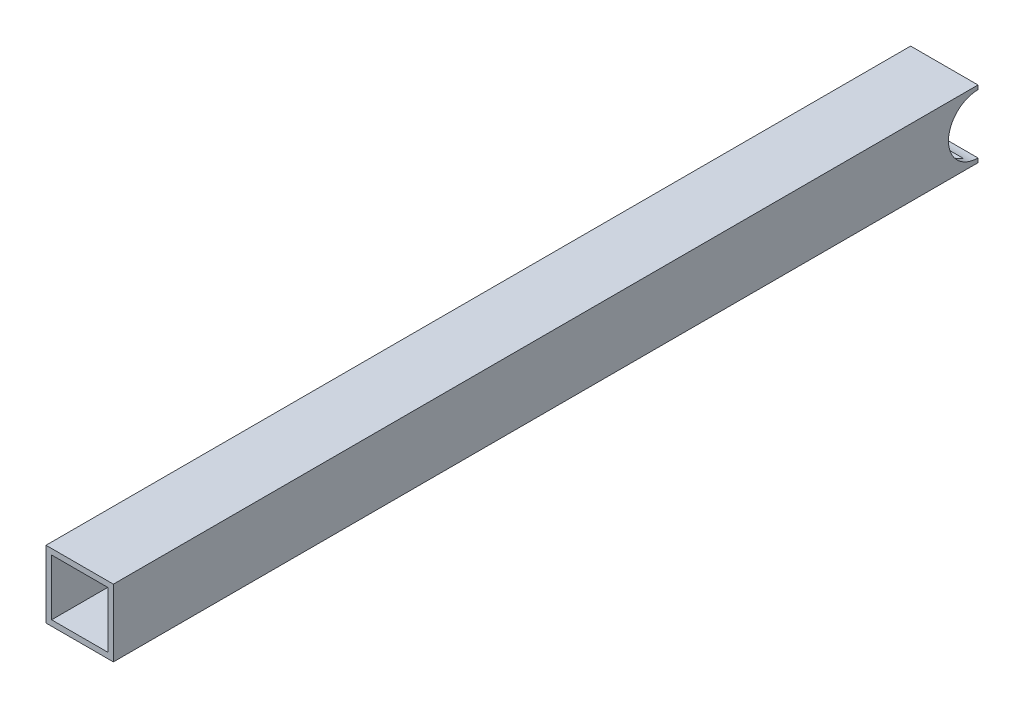
ISO-10303-21;
HEADER;
FILE_DESCRIPTION(('STEP AP214'),'2;1');
FILE_NAME('part.step','',(''),(''),'','','');
FILE_SCHEMA(('AUTOMOTIVE_DESIGN { 1 0 10303 214 1 1 1 1 }'));
ENDSEC;
DATA;
#1=APPLICATION_CONTEXT('core data for automotive mechanical design processes');
#2=APPLICATION_PROTOCOL_DEFINITION('international standard','automotive_design',2000,#1);
#3=PRODUCT_CONTEXT('',#1,'mechanical');
#4=PRODUCT('Part','Part','',(#3));
#5=PRODUCT_RELATED_PRODUCT_CATEGORY('part','',(#4));
#6=PRODUCT_DEFINITION_FORMATION('','',#4);
#7=PRODUCT_DEFINITION_CONTEXT('part definition',#1,'design');
#8=PRODUCT_DEFINITION('design','',#6,#7);
#9=PRODUCT_DEFINITION_SHAPE('','',#8);
#10=(LENGTH_UNIT() NAMED_UNIT(*) SI_UNIT(.MILLI.,.METRE.));
#11=(NAMED_UNIT(*) PLANE_ANGLE_UNIT() SI_UNIT($,.RADIAN.));
#12=(NAMED_UNIT(*) SI_UNIT($,.STERADIAN.) SOLID_ANGLE_UNIT());
#13=UNCERTAINTY_MEASURE_WITH_UNIT(LENGTH_MEASURE(1.E-05),#10,'distance_accuracy_value','');
#14=(GEOMETRIC_REPRESENTATION_CONTEXT(3) GLOBAL_UNCERTAINTY_ASSIGNED_CONTEXT((#13)) GLOBAL_UNIT_ASSIGNED_CONTEXT((#10,
#11,#12)) REPRESENTATION_CONTEXT('',''));
#15=CARTESIAN_POINT('',(0.,0.,0.));
#16=DIRECTION('',(0.,0.,1.));
#17=DIRECTION('',(1.,0.,0.));
#18=AXIS2_PLACEMENT_3D('',#15,#16,#17);
#19=CARTESIAN_POINT('',(15.875,15.875,-244.475));
#20=DIRECTION('',(-1.,0.,0.));
#21=DIRECTION('',(0.,0.,1.));
#22=AXIS2_PLACEMENT_3D('',#19,#20,#21);
#23=PLANE('',#22);
#24=DIRECTION('',(0.,0.,-1.));
#25=VECTOR('',#24,1.);
#26=CARTESIAN_POINT('',(15.875,15.875,-244.475));
#27=LINE('',#26,#25);
#28=CARTESIAN_POINT('',(15.875,15.8750000000009,-239.289339458664));
#29=VERTEX_POINT('',#28);
#30=CARTESIAN_POINT('',(15.875,15.875,244.475));
#31=VERTEX_POINT('',#30);
#32=EDGE_CURVE('E90',#29,#31,#27,.F.);
#33=ORIENTED_EDGE('',*,*,#32,.F.);
#34=CARTESIAN_POINT('',(15.875,0.,-244.475));
#35=DIRECTION('',(1.,0.,0.));
#36=DIRECTION('',(0.,0.,-1.));
#37=AXIS2_PLACEMENT_3D('',#34,#35,#36);
#38=CIRCLE('',#37,16.7005);
#39=CARTESIAN_POINT('',(15.875,-15.8750000000009,-239.289339458664));
#40=VERTEX_POINT('',#39);
#41=EDGE_CURVE('E20',#29,#40,#38,.T.);
#42=ORIENTED_EDGE('',*,*,#41,.T.);
#43=DIRECTION('',(0.,0.,1.));
#44=VECTOR('',#43,1.);
#45=CARTESIAN_POINT('',(15.875,-15.875,-244.475));
#46=LINE('',#45,#44);
#47=CARTESIAN_POINT('',(15.875,-15.875,244.475));
#48=VERTEX_POINT('',#47);
#49=EDGE_CURVE('E94',#48,#40,#46,.F.);
#50=ORIENTED_EDGE('',*,*,#49,.F.);
#51=DIRECTION('',(0.,1.,0.));
#52=VECTOR('',#51,1.);
#53=CARTESIAN_POINT('',(15.875,0.,244.475));
#54=LINE('',#53,#52);
#55=EDGE_CURVE('E143',#31,#48,#54,.F.);
#56=ORIENTED_EDGE('',*,*,#55,.F.);
#57=EDGE_LOOP('',(#33,#42,#50,#56));
#58=FACE_BOUND('',#57,.T.);
#59=ADVANCED_FACE('F17',(#58),#23,.T.);
#60=CARTESIAN_POINT('',(15.875,-15.875,-244.475));
#61=DIRECTION('',(0.,1.,0.));
#62=DIRECTION('',(0.,0.,1.));
#63=AXIS2_PLACEMENT_3D('',#60,#61,#62);
#64=PLANE('',#63);
#65=ORIENTED_EDGE('',*,*,#49,.T.);
#66=DIRECTION('',(1.,0.,0.));
#67=VECTOR('',#66,1.);
#68=CARTESIAN_POINT('',(19.05,-15.8750000000018,-239.289339458667));
#69=LINE('',#68,#67);
#70=CARTESIAN_POINT('',(-15.875,-15.8750000000009,-239.289339458664));
#71=VERTEX_POINT('',#70);
#72=EDGE_CURVE('E99',#40,#71,#69,.F.);
#73=ORIENTED_EDGE('',*,*,#72,.T.);
#74=DIRECTION('',(0.,0.,-1.));
#75=VECTOR('',#74,1.);
#76=CARTESIAN_POINT('',(-15.875,-15.875,-244.475));
#77=LINE('',#76,#75);
#78=CARTESIAN_POINT('',(-15.875,-15.875,244.475));
#79=VERTEX_POINT('',#78);
#80=EDGE_CURVE('E107',#79,#71,#77,.T.);
#81=ORIENTED_EDGE('',*,*,#80,.F.);
#82=DIRECTION('',(1.,0.,0.));
#83=VECTOR('',#82,1.);
#84=CARTESIAN_POINT('',(0.,-15.875,244.475));
#85=LINE('',#84,#83);
#86=EDGE_CURVE('E105',#48,#79,#85,.F.);
#87=ORIENTED_EDGE('',*,*,#86,.F.);
#88=EDGE_LOOP('',(#65,#73,#81,#87));
#89=FACE_BOUND('',#88,.T.);
#90=ADVANCED_FACE('F102',(#89),#64,.T.);
#91=CARTESIAN_POINT('',(-15.875,-15.875,-244.475));
#92=DIRECTION('',(1.,0.,0.));
#93=DIRECTION('',(0.,0.,-1.));
#94=AXIS2_PLACEMENT_3D('',#91,#92,#93);
#95=PLANE('',#94);
#96=ORIENTED_EDGE('',*,*,#80,.T.);
#97=CARTESIAN_POINT('',(-15.875,0.,-244.475));
#98=DIRECTION('',(1.,0.,0.));
#99=DIRECTION('',(0.,0.,-1.));
#100=AXIS2_PLACEMENT_3D('',#97,#98,#99);
#101=CIRCLE('',#100,16.7005);
#102=CARTESIAN_POINT('',(-15.875,15.8750000000009,-239.289339458664));
#103=VERTEX_POINT('',#102);
#104=EDGE_CURVE('E112',#71,#103,#101,.F.);
#105=ORIENTED_EDGE('',*,*,#104,.T.);
#106=DIRECTION('',(0.,0.,-1.));
#107=VECTOR('',#106,1.);
#108=CARTESIAN_POINT('',(-15.875,15.875,-244.475));
#109=LINE('',#108,#107);
#110=CARTESIAN_POINT('',(-15.875,15.875,244.475));
#111=VERTEX_POINT('',#110);
#112=EDGE_CURVE('E119',#111,#103,#109,.T.);
#113=ORIENTED_EDGE('',*,*,#112,.F.);
#114=DIRECTION('',(0.,1.,0.));
#115=VECTOR('',#114,1.);
#116=CARTESIAN_POINT('',(-15.875,0.,244.475));
#117=LINE('',#116,#115);
#118=EDGE_CURVE('E136',#79,#111,#117,.T.);
#119=ORIENTED_EDGE('',*,*,#118,.F.);
#120=EDGE_LOOP('',(#96,#105,#113,#119));
#121=FACE_BOUND('',#120,.T.);
#122=ADVANCED_FACE('F220',(#121),#95,.T.);
#123=CARTESIAN_POINT('',(-15.875,15.875,-244.475));
#124=DIRECTION('',(0.,-1.,0.));
#125=DIRECTION('',(0.,0.,-1.));
#126=AXIS2_PLACEMENT_3D('',#123,#124,#125);
#127=PLANE('',#126);
#128=ORIENTED_EDGE('',*,*,#112,.T.);
#129=DIRECTION('',(1.,0.,0.));
#130=VECTOR('',#129,1.);
#131=CARTESIAN_POINT('',(19.05,15.8750000000018,-239.289339458667));
#132=LINE('',#131,#130);
#133=EDGE_CURVE('E114',#103,#29,#132,.T.);
#134=ORIENTED_EDGE('',*,*,#133,.T.);
#135=ORIENTED_EDGE('',*,*,#32,.T.);
#136=DIRECTION('',(1.,0.,0.));
#137=VECTOR('',#136,1.);
#138=CARTESIAN_POINT('',(0.,15.875,244.475));
#139=LINE('',#138,#137);
#140=EDGE_CURVE('E132',#111,#31,#139,.T.);
#141=ORIENTED_EDGE('',*,*,#140,.F.);
#142=EDGE_LOOP('',(#128,#134,#135,#141));
#143=FACE_BOUND('',#142,.T.);
#144=ADVANCED_FACE('F224',(#143),#127,.T.);
#145=CARTESIAN_POINT('',(-19.05,-19.05,-244.475));
#146=DIRECTION('',(0.,-1.,0.));
#147=DIRECTION('',(0.,0.,-1.));
#148=AXIS2_PLACEMENT_3D('',#145,#146,#147);
#149=PLANE('',#148);
#150=DIRECTION('',(0.,0.,1.));
#151=VECTOR('',#150,1.);
#152=CARTESIAN_POINT('',(-19.05,-19.05,-244.475));
#153=LINE('',#152,#151);
#154=CARTESIAN_POINT('',(-19.05,-19.05,-244.475));
#155=VERTEX_POINT('',#154);
#156=CARTESIAN_POINT('',(-19.05,-19.05,244.475));
#157=VERTEX_POINT('',#156);
#158=EDGE_CURVE('E158',#155,#157,#153,.T.);
#159=ORIENTED_EDGE('',*,*,#158,.F.);
#160=DIRECTION('',(1.,0.,0.));
#161=VECTOR('',#160,1.);
#162=CARTESIAN_POINT('',(0.,-19.05,-244.475));
#163=LINE('',#162,#161);
#164=CARTESIAN_POINT('',(19.05,-19.05,-244.475));
#165=VERTEX_POINT('',#164);
#166=EDGE_CURVE('E122',#155,#165,#163,.T.);
#167=ORIENTED_EDGE('',*,*,#166,.T.);
#168=DIRECTION('',(0.,0.,-1.));
#169=VECTOR('',#168,1.);
#170=CARTESIAN_POINT('',(19.05,-19.05,-244.475));
#171=LINE('',#170,#169);
#172=CARTESIAN_POINT('',(19.05,-19.05,244.475));
#173=VERTEX_POINT('',#172);
#174=EDGE_CURVE('E207',#173,#165,#171,.T.);
#175=ORIENTED_EDGE('',*,*,#174,.F.);
#176=DIRECTION('',(1.,0.,0.));
#177=VECTOR('',#176,1.);
#178=CARTESIAN_POINT('',(0.,-19.05,244.475));
#179=LINE('',#178,#177);
#180=EDGE_CURVE('E157',#157,#173,#179,.T.);
#181=ORIENTED_EDGE('',*,*,#180,.F.);
#182=EDGE_LOOP('',(#159,#167,#175,#181));
#183=FACE_BOUND('',#182,.T.);
#184=ADVANCED_FACE('F226',(#183),#149,.T.);
#185=CARTESIAN_POINT('',(0.,0.,-244.475));
#186=DIRECTION('',(0.,0.,1.));
#187=DIRECTION('',(1.,0.,0.));
#188=AXIS2_PLACEMENT_3D('',#185,#186,#187);
#189=PLANE('',#188);
#190=ORIENTED_EDGE('',*,*,#166,.F.);
#191=DIRECTION('',(0.,1.,0.));
#192=VECTOR('',#191,1.);
#193=CARTESIAN_POINT('',(-19.05,19.05,-244.475));
#194=LINE('',#193,#192);
#195=CARTESIAN_POINT('',(-19.05,-16.7005,-244.475));
#196=VERTEX_POINT('',#195);
#197=EDGE_CURVE('E125',#196,#155,#194,.F.);
#198=ORIENTED_EDGE('',*,*,#197,.F.);
#199=DIRECTION('',(1.,0.,0.));
#200=VECTOR('',#199,1.);
#201=CARTESIAN_POINT('',(19.05,-16.7005,-244.475));
#202=LINE('',#201,#200);
#203=CARTESIAN_POINT('',(19.05,-16.7005,-244.475));
#204=VERTEX_POINT('',#203);
#205=EDGE_CURVE('E100',#196,#204,#202,.T.);
#206=ORIENTED_EDGE('',*,*,#205,.T.);
#207=DIRECTION('',(0.,1.,0.));
#208=VECTOR('',#207,1.);
#209=CARTESIAN_POINT('',(19.05,-19.05,-244.475));
#210=LINE('',#209,#208);
#211=EDGE_CURVE('E154',#165,#204,#210,.T.);
#212=ORIENTED_EDGE('',*,*,#211,.F.);
#213=EDGE_LOOP('',(#190,#198,#206,#212));
#214=FACE_BOUND('',#213,.T.);
#215=ADVANCED_FACE('F233',(#214),#189,.F.);
#216=CARTESIAN_POINT('',(19.05,0.,-244.475));
#217=DIRECTION('',(1.,0.,0.));
#218=DIRECTION('',(0.,0.,-1.));
#219=AXIS2_PLACEMENT_3D('',#216,#217,#218);
#220=CYLINDRICAL_SURFACE('',#219,16.7005);
#221=ORIENTED_EDGE('',*,*,#104,.F.);
#222=ORIENTED_EDGE('',*,*,#72,.F.);
#223=ORIENTED_EDGE('',*,*,#41,.F.);
#224=ORIENTED_EDGE('',*,*,#133,.F.);
#225=EDGE_LOOP('',(#221,#222,#223,#224));
#226=FACE_BOUND('',#225,.T.);
#227=CARTESIAN_POINT('',(19.05,0.,-244.475));
#228=DIRECTION('',(1.,0.,0.));
#229=DIRECTION('',(0.,0.,-1.));
#230=AXIS2_PLACEMENT_3D('',#227,#228,#229);
#231=CIRCLE('',#230,16.7005);
#232=CARTESIAN_POINT('',(19.05,16.7005,-244.475));
#233=VERTEX_POINT('',#232);
#234=EDGE_CURVE('E151',#204,#233,#231,.F.);
#235=ORIENTED_EDGE('',*,*,#234,.F.);
#236=ORIENTED_EDGE('',*,*,#205,.F.);
#237=CARTESIAN_POINT('',(-19.05,0.,-244.475));
#238=DIRECTION('',(1.,0.,0.));
#239=DIRECTION('',(0.,0.,-1.));
#240=AXIS2_PLACEMENT_3D('',#237,#238,#239);
#241=CIRCLE('',#240,16.7005);
#242=CARTESIAN_POINT('',(-19.05,16.7005,-244.475));
#243=VERTEX_POINT('',#242);
#244=EDGE_CURVE('E155',#243,#196,#241,.T.);
#245=ORIENTED_EDGE('',*,*,#244,.F.);
#246=DIRECTION('',(1.,0.,0.));
#247=VECTOR('',#246,1.);
#248=CARTESIAN_POINT('',(0.,16.7005,-244.475));
#249=LINE('',#248,#247);
#250=EDGE_CURVE('E153',#243,#233,#249,.T.);
#251=ORIENTED_EDGE('',*,*,#250,.T.);
#252=EDGE_LOOP('',(#235,#236,#245,#251));
#253=FACE_BOUND('',#252,.T.);
#254=ADVANCED_FACE('F110',(#226,#253),#220,.F.);
#255=CARTESIAN_POINT('',(-19.05,19.05,-244.475));
#256=DIRECTION('',(-1.,0.,0.));
#257=DIRECTION('',(0.,0.,1.));
#258=AXIS2_PLACEMENT_3D('',#255,#256,#257);
#259=PLANE('',#258);
#260=DIRECTION('',(0.,1.,0.));
#261=VECTOR('',#260,1.);
#262=CARTESIAN_POINT('',(-19.05,0.,-244.475));
#263=LINE('',#262,#261);
#264=CARTESIAN_POINT('',(-19.05,19.05,-244.475));
#265=VERTEX_POINT('',#264);
#266=EDGE_CURVE('E185',#265,#243,#263,.F.);
#267=ORIENTED_EDGE('',*,*,#266,.T.);
#268=ORIENTED_EDGE('',*,*,#244,.T.);
#269=ORIENTED_EDGE('',*,*,#197,.T.);
#270=ORIENTED_EDGE('',*,*,#158,.T.);
#271=DIRECTION('',(0.,1.,0.));
#272=VECTOR('',#271,1.);
#273=CARTESIAN_POINT('',(-19.05,0.,244.475));
#274=LINE('',#273,#272);
#275=CARTESIAN_POINT('',(-19.05,19.05,244.475));
#276=VERTEX_POINT('',#275);
#277=EDGE_CURVE('E145',#276,#157,#274,.F.);
#278=ORIENTED_EDGE('',*,*,#277,.F.);
#279=DIRECTION('',(0.,0.,1.));
#280=VECTOR('',#279,1.);
#281=CARTESIAN_POINT('',(-19.05,19.05,-244.475));
#282=LINE('',#281,#280);
#283=EDGE_CURVE('E183',#265,#276,#282,.T.);
#284=ORIENTED_EDGE('',*,*,#283,.F.);
#285=EDGE_LOOP('',(#267,#268,#269,#270,#278,#284));
#286=FACE_BOUND('',#285,.T.);
#287=ADVANCED_FACE('F182',(#286),#259,.T.);
#288=CARTESIAN_POINT('',(0.,0.,244.475));
#289=DIRECTION('',(0.,0.,1.));
#290=DIRECTION('',(1.,0.,0.));
#291=AXIS2_PLACEMENT_3D('',#288,#289,#290);
#292=PLANE('',#291);
#293=ORIENTED_EDGE('',*,*,#118,.T.);
#294=ORIENTED_EDGE('',*,*,#140,.T.);
#295=ORIENTED_EDGE('',*,*,#55,.T.);
#296=ORIENTED_EDGE('',*,*,#86,.T.);
#297=EDGE_LOOP('',(#293,#294,#295,#296));
#298=FACE_BOUND('',#297,.T.);
#299=DIRECTION('',(1.,0.,0.));
#300=VECTOR('',#299,1.);
#301=CARTESIAN_POINT('',(19.05,19.05,244.475));
#302=LINE('',#301,#300);
#303=CARTESIAN_POINT('',(19.05,19.05,244.475));
#304=VERTEX_POINT('',#303);
#305=EDGE_CURVE('E179',#276,#304,#302,.T.);
#306=ORIENTED_EDGE('',*,*,#305,.F.);
#307=ORIENTED_EDGE('',*,*,#277,.T.);
#308=ORIENTED_EDGE('',*,*,#180,.T.);
#309=DIRECTION('',(0.,1.,0.));
#310=VECTOR('',#309,1.);
#311=CARTESIAN_POINT('',(19.05,-19.05,244.475));
#312=LINE('',#311,#310);
#313=EDGE_CURVE('E135',#304,#173,#312,.F.);
#314=ORIENTED_EDGE('',*,*,#313,.F.);
#315=EDGE_LOOP('',(#306,#307,#308,#314));
#316=FACE_BOUND('',#315,.T.);
#317=ADVANCED_FACE('F176',(#298,#316),#292,.T.);
#318=CARTESIAN_POINT('',(19.05,-19.05,-244.475));
#319=DIRECTION('',(1.,0.,0.));
#320=DIRECTION('',(0.,0.,-1.));
#321=AXIS2_PLACEMENT_3D('',#318,#319,#320);
#322=PLANE('',#321);
#323=ORIENTED_EDGE('',*,*,#211,.T.);
#324=ORIENTED_EDGE('',*,*,#234,.T.);
#325=DIRECTION('',(0.,1.,0.));
#326=VECTOR('',#325,1.);
#327=CARTESIAN_POINT('',(19.05,0.,-244.475));
#328=LINE('',#327,#326);
#329=CARTESIAN_POINT('',(19.05,19.05,-244.475));
#330=VERTEX_POINT('',#329);
#331=EDGE_CURVE('E35',#233,#330,#328,.T.);
#332=ORIENTED_EDGE('',*,*,#331,.T.);
#333=DIRECTION('',(0.,0.,1.));
#334=VECTOR('',#333,1.);
#335=CARTESIAN_POINT('',(19.05,19.05,-244.475));
#336=LINE('',#335,#334);
#337=EDGE_CURVE('E26',#304,#330,#336,.F.);
#338=ORIENTED_EDGE('',*,*,#337,.F.);
#339=ORIENTED_EDGE('',*,*,#313,.T.);
#340=ORIENTED_EDGE('',*,*,#174,.T.);
#341=EDGE_LOOP('',(#323,#324,#332,#338,#339,#340));
#342=FACE_BOUND('',#341,.T.);
#343=ADVANCED_FACE('F242',(#342),#322,.T.);
#344=CARTESIAN_POINT('',(0.,0.,-244.475));
#345=DIRECTION('',(0.,0.,1.));
#346=DIRECTION('',(1.,0.,0.));
#347=AXIS2_PLACEMENT_3D('',#344,#345,#346);
#348=PLANE('',#347);
#349=DIRECTION('',(1.,0.,0.));
#350=VECTOR('',#349,1.);
#351=CARTESIAN_POINT('',(19.05,19.05,-244.475));
#352=LINE('',#351,#350);
#353=EDGE_CURVE('E11',#330,#265,#352,.F.);
#354=ORIENTED_EDGE('',*,*,#353,.F.);
#355=ORIENTED_EDGE('',*,*,#331,.F.);
#356=ORIENTED_EDGE('',*,*,#250,.F.);
#357=ORIENTED_EDGE('',*,*,#266,.F.);
#358=EDGE_LOOP('',(#354,#355,#356,#357));
#359=FACE_BOUND('',#358,.T.);
#360=ADVANCED_FACE('F190',(#359),#348,.F.);
#361=CARTESIAN_POINT('',(19.05,19.05,-244.475));
#362=DIRECTION('',(0.,1.,0.));
#363=DIRECTION('',(0.,0.,1.));
#364=AXIS2_PLACEMENT_3D('',#361,#362,#363);
#365=PLANE('',#364);
#366=ORIENTED_EDGE('',*,*,#337,.T.);
#367=ORIENTED_EDGE('',*,*,#353,.T.);
#368=ORIENTED_EDGE('',*,*,#283,.T.);
#369=ORIENTED_EDGE('',*,*,#305,.T.);
#370=EDGE_LOOP('',(#366,#367,#368,#369));
#371=FACE_BOUND('',#370,.T.);
#372=ADVANCED_FACE('F193',(#371),#365,.T.);
#373=CLOSED_SHELL('',(#59,#90,#122,#144,#184,#215,#254,#287,#317,#343,#360,#372));
#374=MANIFOLD_SOLID_BREP('B1',#373);
#375=ADVANCED_BREP_SHAPE_REPRESENTATION('',(#18,#374),#14);
#376=SHAPE_DEFINITION_REPRESENTATION(#9,#375);
ENDSEC;
END-ISO-10303-21;
